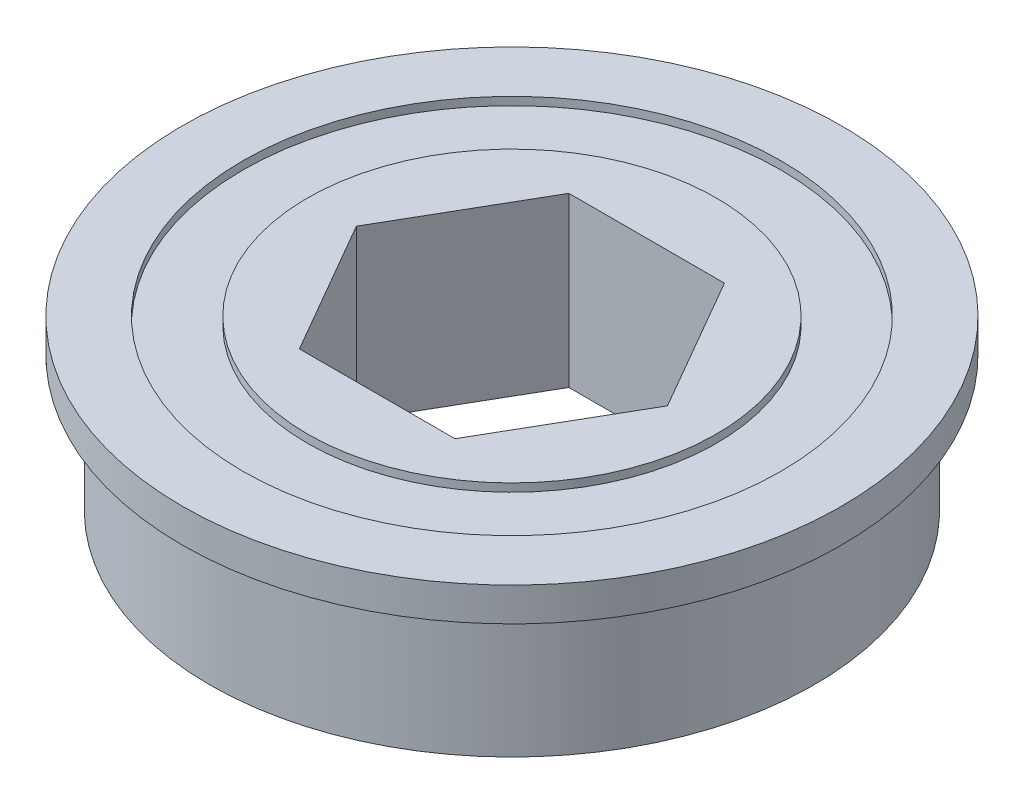
ISO-10303-21;
HEADER;
FILE_DESCRIPTION(('STEP AP214'),'2;1');
FILE_NAME('part.step','',(''),(''),'','','');
FILE_SCHEMA(('AUTOMOTIVE_DESIGN { 1 0 10303 214 1 1 1 1 }'));
ENDSEC;
DATA;
#1=APPLICATION_CONTEXT('core data for automotive mechanical design processes');
#2=APPLICATION_PROTOCOL_DEFINITION('international standard','automotive_design',2000,#1);
#3=PRODUCT_CONTEXT('',#1,'mechanical');
#4=PRODUCT('Part','Part','',(#3));
#5=PRODUCT_RELATED_PRODUCT_CATEGORY('part','',(#4));
#6=PRODUCT_DEFINITION_FORMATION('','',#4);
#7=PRODUCT_DEFINITION_CONTEXT('part definition',#1,'design');
#8=PRODUCT_DEFINITION('design','',#6,#7);
#9=PRODUCT_DEFINITION_SHAPE('','',#8);
#10=(LENGTH_UNIT() NAMED_UNIT(*) SI_UNIT(.MILLI.,.METRE.));
#11=(NAMED_UNIT(*) PLANE_ANGLE_UNIT() SI_UNIT($,.RADIAN.));
#12=(NAMED_UNIT(*) SI_UNIT($,.STERADIAN.) SOLID_ANGLE_UNIT());
#13=UNCERTAINTY_MEASURE_WITH_UNIT(LENGTH_MEASURE(1.E-05),#10,'distance_accuracy_value','');
#14=(GEOMETRIC_REPRESENTATION_CONTEXT(3) GLOBAL_UNCERTAINTY_ASSIGNED_CONTEXT((#13)) GLOBAL_UNIT_ASSIGNED_CONTEXT((#10,
#11,#12)) REPRESENTATION_CONTEXT('',''));
#15=CARTESIAN_POINT('',(0.,0.,0.));
#16=DIRECTION('',(0.,0.,1.));
#17=DIRECTION('',(1.,0.,0.));
#18=AXIS2_PLACEMENT_3D('',#15,#16,#17);
#19=CARTESIAN_POINT('',(0.,0.,0.));
#20=DIRECTION('',(0.,1.,0.));
#21=DIRECTION('',(0.,0.,1.));
#22=AXIS2_PLACEMENT_3D('',#19,#20,#21);
#23=CYLINDRICAL_SURFACE('',#22,12.7);
#24=CARTESIAN_POINT('',(0.,0.381,0.));
#25=DIRECTION('',(0.,1.,0.));
#26=DIRECTION('',(0.,0.,1.));
#27=AXIS2_PLACEMENT_3D('',#24,#25,#26);
#28=CIRCLE('',#27,12.7);
#29=CARTESIAN_POINT('',(0.,0.381,12.7));
#30=VERTEX_POINT('',#29);
#31=EDGE_CURVE('E361',#30,#30,#28,.F.);
#32=ORIENTED_EDGE('',*,*,#31,.F.);
#33=EDGE_LOOP('',(#32));
#34=FACE_BOUND('',#33,.T.);
#35=CARTESIAN_POINT('',(0.,0.,0.));
#36=DIRECTION('',(0.,1.,0.));
#37=DIRECTION('',(0.,0.,1.));
#38=AXIS2_PLACEMENT_3D('',#35,#36,#37);
#39=CIRCLE('',#38,12.7);
#40=CARTESIAN_POINT('',(0.,0.,12.7));
#41=VERTEX_POINT('',#40);
#42=EDGE_CURVE('E355',#41,#41,#39,.T.);
#43=ORIENTED_EDGE('',*,*,#42,.F.);
#44=EDGE_LOOP('',(#43));
#45=FACE_BOUND('',#44,.T.);
#46=ADVANCED_FACE('F19',(#34,#45),#23,.F.);
#47=CARTESIAN_POINT('',(9.652,0.381,0.));
#48=DIRECTION('',(0.,-1.,0.));
#49=DIRECTION('',(0.,0.,-1.));
#50=AXIS2_PLACEMENT_3D('',#47,#48,#49);
#51=PLANE('',#50);
#52=ORIENTED_EDGE('',*,*,#31,.T.);
#53=EDGE_LOOP('',(#52));
#54=FACE_BOUND('',#53,.T.);
#55=CARTESIAN_POINT('',(0.,0.381,0.));
#56=DIRECTION('',(0.,1.,0.));
#57=DIRECTION('',(0.,0.,1.));
#58=AXIS2_PLACEMENT_3D('',#55,#56,#57);
#59=CIRCLE('',#58,9.652);
#60=CARTESIAN_POINT('',(0.,0.381,9.652));
#61=VERTEX_POINT('',#60);
#62=EDGE_CURVE('E360',#61,#61,#59,.F.);
#63=ORIENTED_EDGE('',*,*,#62,.F.);
#64=EDGE_LOOP('',(#63));
#65=FACE_BOUND('',#64,.T.);
#66=ADVANCED_FACE('F266',(#54,#65),#51,.T.);
#67=CARTESIAN_POINT('',(14.2748,0.,0.));
#68=DIRECTION('',(0.,-1.,0.));
#69=DIRECTION('',(0.,0.,-1.));
#70=AXIS2_PLACEMENT_3D('',#67,#68,#69);
#71=PLANE('',#70);
#72=CARTESIAN_POINT('',(0.,0.,0.));
#73=DIRECTION('',(0.,1.,0.));
#74=DIRECTION('',(0.,0.,1.));
#75=AXIS2_PLACEMENT_3D('',#72,#73,#74);
#76=CIRCLE('',#75,14.2748);
#77=CARTESIAN_POINT('',(0.,0.,14.2748));
#78=VERTEX_POINT('',#77);
#79=EDGE_CURVE('E367',#78,#78,#76,.T.);
#80=ORIENTED_EDGE('',*,*,#79,.F.);
#81=EDGE_LOOP('',(#80));
#82=FACE_BOUND('',#81,.T.);
#83=ORIENTED_EDGE('',*,*,#42,.T.);
#84=EDGE_LOOP('',(#83));
#85=FACE_BOUND('',#84,.T.);
#86=ADVANCED_FACE('F263',(#82,#85),#71,.T.);
#87=CARTESIAN_POINT('',(0.,0.,0.));
#88=DIRECTION('',(0.,1.,0.));
#89=DIRECTION('',(0.,0.,1.));
#90=AXIS2_PLACEMENT_3D('',#87,#88,#89);
#91=CYLINDRICAL_SURFACE('',#90,9.652);
#92=CARTESIAN_POINT('',(0.,0.,0.));
#93=DIRECTION('',(0.,1.,0.));
#94=DIRECTION('',(0.,0.,1.));
#95=AXIS2_PLACEMENT_3D('',#92,#93,#94);
#96=CIRCLE('',#95,9.652);
#97=CARTESIAN_POINT('',(0.,0.,9.652));
#98=VERTEX_POINT('',#97);
#99=EDGE_CURVE('E371',#98,#98,#96,.F.);
#100=ORIENTED_EDGE('',*,*,#99,.F.);
#101=EDGE_LOOP('',(#100));
#102=FACE_BOUND('',#101,.T.);
#103=ORIENTED_EDGE('',*,*,#62,.T.);
#104=EDGE_LOOP('',(#103));
#105=FACE_BOUND('',#104,.T.);
#106=ADVANCED_FACE('F259',(#102,#105),#91,.T.);
#107=CARTESIAN_POINT('',(0.,0.,0.));
#108=DIRECTION('',(0.,1.,0.));
#109=DIRECTION('',(0.,0.,1.));
#110=AXIS2_PLACEMENT_3D('',#107,#108,#109);
#111=CYLINDRICAL_SURFACE('',#110,14.2748);
#112=ORIENTED_EDGE('',*,*,#79,.T.);
#113=EDGE_LOOP('',(#112));
#114=FACE_BOUND('',#113,.T.);
#115=CARTESIAN_POINT('',(0.,5.6,0.));
#116=DIRECTION('',(0.,-1.,0.));
#117=DIRECTION('',(0.,0.,-1.));
#118=AXIS2_PLACEMENT_3D('',#115,#116,#117);
#119=CIRCLE('',#118,14.2748);
#120=CARTESIAN_POINT('',(0.,5.6,-14.2748));
#121=VERTEX_POINT('',#120);
#122=EDGE_CURVE('E85',#121,#121,#119,.F.);
#123=ORIENTED_EDGE('',*,*,#122,.F.);
#124=EDGE_LOOP('',(#123));
#125=FACE_BOUND('',#124,.T.);
#126=ADVANCED_FACE('F255',(#114,#125),#111,.T.);
#127=CARTESIAN_POINT('',(9.652,0.,0.));
#128=DIRECTION('',(0.,-1.,0.));
#129=DIRECTION('',(0.,0.,-1.));
#130=AXIS2_PLACEMENT_3D('',#127,#128,#129);
#131=PLANE('',#130);
#132=ORIENTED_EDGE('',*,*,#99,.T.);
#133=EDGE_LOOP('',(#132));
#134=FACE_BOUND('',#133,.T.);
#135=DIRECTION('',(1.,0.,0.));
#136=VECTOR('',#135,1.);
#137=CARTESIAN_POINT('',(-3.67194771204601,0.,6.36));
#138=LINE('',#137,#136);
#139=CARTESIAN_POINT('',(-3.67194771204601,0.,6.36));
#140=VERTEX_POINT('',#139);
#141=CARTESIAN_POINT('',(3.67194771204602,0.,6.36));
#142=VERTEX_POINT('',#141);
#143=EDGE_CURVE('E64',#140,#142,#138,.T.);
#144=ORIENTED_EDGE('',*,*,#143,.T.);
#145=DIRECTION('',(0.5,0.,-0.866025403784439));
#146=VECTOR('',#145,1.);
#147=CARTESIAN_POINT('',(3.67194771204602,0.,6.36));
#148=LINE('',#147,#146);
#149=CARTESIAN_POINT('',(7.34389542409204,0.,0.));
#150=VERTEX_POINT('',#149);
#151=EDGE_CURVE('E66',#142,#150,#148,.T.);
#152=ORIENTED_EDGE('',*,*,#151,.T.);
#153=DIRECTION('',(-0.5,0.,-0.866025403784439));
#154=VECTOR('',#153,1.);
#155=CARTESIAN_POINT('',(7.34389542409204,0.,0.));
#156=LINE('',#155,#154);
#157=CARTESIAN_POINT('',(3.67194771204602,0.,-6.36));
#158=VERTEX_POINT('',#157);
#159=EDGE_CURVE('E69',#150,#158,#156,.T.);
#160=ORIENTED_EDGE('',*,*,#159,.T.);
#161=DIRECTION('',(-1.,0.,0.));
#162=VECTOR('',#161,1.);
#163=CARTESIAN_POINT('',(3.67194771204602,0.,-6.36));
#164=LINE('',#163,#162);
#165=CARTESIAN_POINT('',(-3.67194771204602,0.,-6.36));
#166=VERTEX_POINT('',#165);
#167=EDGE_CURVE('E334',#158,#166,#164,.T.);
#168=ORIENTED_EDGE('',*,*,#167,.T.);
#169=DIRECTION('',(-0.5,0.,0.866025403784439));
#170=VECTOR('',#169,1.);
#171=CARTESIAN_POINT('',(-3.67194771204602,0.,-6.36));
#172=LINE('',#171,#170);
#173=CARTESIAN_POINT('',(-7.34389542409204,0.,0.));
#174=VERTEX_POINT('',#173);
#175=EDGE_CURVE('E121',#166,#174,#172,.T.);
#176=ORIENTED_EDGE('',*,*,#175,.T.);
#177=DIRECTION('',(0.5,0.,0.866025403784439));
#178=VECTOR('',#177,1.);
#179=CARTESIAN_POINT('',(-7.34389542409204,0.,0.));
#180=LINE('',#179,#178);
#181=EDGE_CURVE('E112',#174,#140,#180,.T.);
#182=ORIENTED_EDGE('',*,*,#181,.T.);
#183=EDGE_LOOP('',(#144,#152,#160,#168,#176,#182));
#184=FACE_BOUND('',#183,.T.);
#185=ADVANCED_FACE('F68',(#134,#184),#131,.T.);
#186=CARTESIAN_POINT('',(0.,5.6,0.));
#187=DIRECTION('',(0.,-1.,0.));
#188=DIRECTION('',(0.,0.,-1.));
#189=AXIS2_PLACEMENT_3D('',#186,#187,#188);
#190=CONICAL_SURFACE('',#189,14.2748,0.523598775598298);
#191=CARTESIAN_POINT('',(0.,5.975,0.));
#192=DIRECTION('',(0.,1.,0.));
#193=DIRECTION('',(0.,0.,1.));
#194=AXIS2_PLACEMENT_3D('',#191,#192,#193);
#195=CIRCLE('',#194,14.0582936490539);
#196=CARTESIAN_POINT('',(0.,5.975,14.0582936490539));
#197=VERTEX_POINT('',#196);
#198=EDGE_CURVE('E328',#197,#197,#195,.F.);
#199=ORIENTED_EDGE('',*,*,#198,.T.);
#200=EDGE_LOOP('',(#199));
#201=FACE_BOUND('',#200,.T.);
#202=ORIENTED_EDGE('',*,*,#122,.T.);
#203=EDGE_LOOP('',(#202));
#204=FACE_BOUND('',#203,.T.);
#205=ADVANCED_FACE('F249',(#201,#204),#190,.T.);
#206=CARTESIAN_POINT('',(7.34389542409204,0.,0.));
#207=DIRECTION('',(0.866025403784439,0.,-0.5));
#208=DIRECTION('',(-0.5,0.,-0.866025403784439));
#209=AXIS2_PLACEMENT_3D('',#206,#207,#208);
#210=PLANE('',#209);
#211=DIRECTION('',(0.,1.,0.));
#212=VECTOR('',#211,1.);
#213=CARTESIAN_POINT('',(3.67194771204602,0.,-6.36));
#214=LINE('',#213,#212);
#215=CARTESIAN_POINT('',(3.67194771204602,7.9375,-6.36));
#216=VERTEX_POINT('',#215);
#217=EDGE_CURVE('E83',#216,#158,#214,.F.);
#218=ORIENTED_EDGE('',*,*,#217,.T.);
#219=ORIENTED_EDGE('',*,*,#159,.F.);
#220=DIRECTION('',(0.,1.,0.));
#221=VECTOR('',#220,1.);
#222=CARTESIAN_POINT('',(7.34389542409204,0.,0.));
#223=LINE('',#222,#221);
#224=CARTESIAN_POINT('',(7.34389542409204,7.9375,0.));
#225=VERTEX_POINT('',#224);
#226=EDGE_CURVE('E75',#150,#225,#223,.T.);
#227=ORIENTED_EDGE('',*,*,#226,.T.);
#228=DIRECTION('',(0.5,0.,0.866025403784438));
#229=VECTOR('',#228,1.);
#230=CARTESIAN_POINT('',(3.67194771204602,7.9375,-6.36));
#231=LINE('',#230,#229);
#232=EDGE_CURVE('E321',#216,#225,#231,.T.);
#233=ORIENTED_EDGE('',*,*,#232,.F.);
#234=EDGE_LOOP('',(#218,#219,#227,#233));
#235=FACE_BOUND('',#234,.T.);
#236=ADVANCED_FACE('F79',(#235),#210,.F.);
#237=CARTESIAN_POINT('',(3.67194771204602,0.,6.36));
#238=DIRECTION('',(0.866025403784439,0.,0.5));
#239=DIRECTION('',(0.5,0.,-0.866025403784439));
#240=AXIS2_PLACEMENT_3D('',#237,#238,#239);
#241=PLANE('',#240);
#242=ORIENTED_EDGE('',*,*,#226,.F.);
#243=ORIENTED_EDGE('',*,*,#151,.F.);
#244=DIRECTION('',(0.,1.,0.));
#245=VECTOR('',#244,1.);
#246=CARTESIAN_POINT('',(3.67194771204602,0.,6.36));
#247=LINE('',#246,#245);
#248=CARTESIAN_POINT('',(3.67194771204602,7.9375,6.36));
#249=VERTEX_POINT('',#248);
#250=EDGE_CURVE('E92',#142,#249,#247,.T.);
#251=ORIENTED_EDGE('',*,*,#250,.T.);
#252=DIRECTION('',(-0.5,0.,0.866025403784439));
#253=VECTOR('',#252,1.);
#254=CARTESIAN_POINT('',(7.34389542409204,7.9375,0.));
#255=LINE('',#254,#253);
#256=EDGE_CURVE('E89',#225,#249,#255,.T.);
#257=ORIENTED_EDGE('',*,*,#256,.F.);
#258=EDGE_LOOP('',(#242,#243,#251,#257));
#259=FACE_BOUND('',#258,.T.);
#260=ADVANCED_FACE('F87',(#259),#241,.F.);
#261=CARTESIAN_POINT('',(-3.67194771204601,0.,6.36));
#262=DIRECTION('',(0.,0.,1.));
#263=DIRECTION('',(1.,0.,0.));
#264=AXIS2_PLACEMENT_3D('',#261,#262,#263);
#265=PLANE('',#264);
#266=ORIENTED_EDGE('',*,*,#250,.F.);
#267=ORIENTED_EDGE('',*,*,#143,.F.);
#268=DIRECTION('',(0.,1.,0.));
#269=VECTOR('',#268,1.);
#270=CARTESIAN_POINT('',(-3.67194771204601,0.,6.36));
#271=LINE('',#270,#269);
#272=CARTESIAN_POINT('',(-3.67194771204601,7.9375,6.36));
#273=VERTEX_POINT('',#272);
#274=EDGE_CURVE('E117',#140,#273,#271,.T.);
#275=ORIENTED_EDGE('',*,*,#274,.T.);
#276=DIRECTION('',(1.,0.,0.));
#277=VECTOR('',#276,1.);
#278=CARTESIAN_POINT('',(6.35,7.9375,6.36));
#279=LINE('',#278,#277);
#280=EDGE_CURVE('E320',#249,#273,#279,.F.);
#281=ORIENTED_EDGE('',*,*,#280,.F.);
#282=EDGE_LOOP('',(#266,#267,#275,#281));
#283=FACE_BOUND('',#282,.T.);
#284=ADVANCED_FACE('F240',(#283),#265,.F.);
#285=CARTESIAN_POINT('',(-7.34389542409204,0.,0.));
#286=DIRECTION('',(-0.866025403784439,0.,0.5));
#287=DIRECTION('',(0.5,0.,0.866025403784439));
#288=AXIS2_PLACEMENT_3D('',#285,#286,#287);
#289=PLANE('',#288);
#290=ORIENTED_EDGE('',*,*,#274,.F.);
#291=ORIENTED_EDGE('',*,*,#181,.F.);
#292=DIRECTION('',(0.,1.,0.));
#293=VECTOR('',#292,1.);
#294=CARTESIAN_POINT('',(-7.34389542409204,0.,0.));
#295=LINE('',#294,#293);
#296=CARTESIAN_POINT('',(-7.34389542409204,7.9375,0.));
#297=VERTEX_POINT('',#296);
#298=EDGE_CURVE('E124',#174,#297,#295,.T.);
#299=ORIENTED_EDGE('',*,*,#298,.T.);
#300=DIRECTION('',(-0.5,0.,-0.866025403784439));
#301=VECTOR('',#300,1.);
#302=CARTESIAN_POINT('',(-3.67194771204601,7.9375,6.36));
#303=LINE('',#302,#301);
#304=EDGE_CURVE('E148',#273,#297,#303,.T.);
#305=ORIENTED_EDGE('',*,*,#304,.F.);
#306=EDGE_LOOP('',(#290,#291,#299,#305));
#307=FACE_BOUND('',#306,.T.);
#308=ADVANCED_FACE('F236',(#307),#289,.F.);
#309=CARTESIAN_POINT('',(-3.67194771204602,0.,-6.36));
#310=DIRECTION('',(-0.866025403784439,0.,-0.5));
#311=DIRECTION('',(-0.5,0.,0.866025403784439));
#312=AXIS2_PLACEMENT_3D('',#309,#310,#311);
#313=PLANE('',#312);
#314=ORIENTED_EDGE('',*,*,#298,.F.);
#315=ORIENTED_EDGE('',*,*,#175,.F.);
#316=DIRECTION('',(0.,1.,0.));
#317=VECTOR('',#316,1.);
#318=CARTESIAN_POINT('',(-3.67194771204602,0.,-6.36));
#319=LINE('',#318,#317);
#320=CARTESIAN_POINT('',(-3.67194771204602,7.9375,-6.36));
#321=VERTEX_POINT('',#320);
#322=EDGE_CURVE('E329',#166,#321,#319,.T.);
#323=ORIENTED_EDGE('',*,*,#322,.T.);
#324=DIRECTION('',(0.5,0.,-0.866025403784439));
#325=VECTOR('',#324,1.);
#326=CARTESIAN_POINT('',(-7.34389542409204,7.9375,0.));
#327=LINE('',#326,#325);
#328=EDGE_CURVE('E143',#297,#321,#327,.T.);
#329=ORIENTED_EDGE('',*,*,#328,.F.);
#330=EDGE_LOOP('',(#314,#315,#323,#329));
#331=FACE_BOUND('',#330,.T.);
#332=ADVANCED_FACE('F232',(#331),#313,.F.);
#333=CARTESIAN_POINT('',(3.67194771204602,0.,-6.36));
#334=DIRECTION('',(0.,0.,-1.));
#335=DIRECTION('',(-1.,0.,0.));
#336=AXIS2_PLACEMENT_3D('',#333,#334,#335);
#337=PLANE('',#336);
#338=ORIENTED_EDGE('',*,*,#322,.F.);
#339=ORIENTED_EDGE('',*,*,#167,.F.);
#340=ORIENTED_EDGE('',*,*,#217,.F.);
#341=DIRECTION('',(1.,0.,0.));
#342=VECTOR('',#341,1.);
#343=CARTESIAN_POINT('',(6.35,7.9375,-6.36));
#344=LINE('',#343,#342);
#345=EDGE_CURVE('E147',#321,#216,#344,.T.);
#346=ORIENTED_EDGE('',*,*,#345,.F.);
#347=EDGE_LOOP('',(#338,#339,#340,#346));
#348=FACE_BOUND('',#347,.T.);
#349=ADVANCED_FACE('F228',(#348),#337,.F.);
#350=CARTESIAN_POINT('',(6.35,7.9375,0.));
#351=DIRECTION('',(0.,1.,0.));
#352=DIRECTION('',(0.,0.,1.));
#353=AXIS2_PLACEMENT_3D('',#350,#351,#352);
#354=PLANE('',#353);
#355=CARTESIAN_POINT('',(0.,7.9375,0.));
#356=DIRECTION('',(0.,1.,0.));
#357=DIRECTION('',(0.,0.,1.));
#358=AXIS2_PLACEMENT_3D('',#355,#356,#357);
#359=CIRCLE('',#358,9.652);
#360=CARTESIAN_POINT('',(0.,7.9375,9.652));
#361=VERTEX_POINT('',#360);
#362=EDGE_CURVE('E375',#361,#361,#359,.F.);
#363=ORIENTED_EDGE('',*,*,#362,.F.);
#364=EDGE_LOOP('',(#363));
#365=FACE_BOUND('',#364,.T.);
#366=ORIENTED_EDGE('',*,*,#328,.T.);
#367=ORIENTED_EDGE('',*,*,#345,.T.);
#368=ORIENTED_EDGE('',*,*,#232,.T.);
#369=ORIENTED_EDGE('',*,*,#256,.T.);
#370=ORIENTED_EDGE('',*,*,#280,.T.);
#371=ORIENTED_EDGE('',*,*,#304,.T.);
#372=EDGE_LOOP('',(#366,#367,#368,#369,#370,#371));
#373=FACE_BOUND('',#372,.T.);
#374=ADVANCED_FACE('F216',(#365,#373),#354,.T.);
#375=CARTESIAN_POINT('',(0.,6.1,0.));
#376=DIRECTION('',(0.,1.,0.));
#377=DIRECTION('',(0.,0.,1.));
#378=AXIS2_PLACEMENT_3D('',#375,#376,#377);
#379=TOROIDAL_SURFACE('',#378,14.2748,0.25);
#380=ORIENTED_EDGE('',*,*,#198,.F.);
#381=EDGE_LOOP('',(#380));
#382=FACE_BOUND('',#381,.T.);
#383=CARTESIAN_POINT('',(0.,6.35,0.));
#384=DIRECTION('',(0.,-1.,0.));
#385=DIRECTION('',(0.,0.,-1.));
#386=AXIS2_PLACEMENT_3D('',#383,#384,#385);
#387=CIRCLE('',#386,14.2748);
#388=CARTESIAN_POINT('',(0.,6.35,14.2748));
#389=VERTEX_POINT('',#388);
#390=CARTESIAN_POINT('',(0.,6.35,-14.2748));
#391=VERTEX_POINT('',#390);
#392=EDGE_CURVE('E377',#389,#391,#387,.F.);
#393=ORIENTED_EDGE('',*,*,#392,.F.);
#394=CARTESIAN_POINT('',(0.,6.35,0.));
#395=DIRECTION('',(0.,-1.,0.));
#396=DIRECTION('',(0.,0.,1.));
#397=AXIS2_PLACEMENT_3D('',#394,#395,#396);
#398=CIRCLE('',#397,14.2748);
#399=EDGE_CURVE('E38',#391,#389,#398,.F.);
#400=ORIENTED_EDGE('',*,*,#399,.F.);
#401=EDGE_LOOP('',(#393,#400));
#402=FACE_BOUND('',#401,.T.);
#403=ADVANCED_FACE('F212',(#382,#402),#379,.F.);
#404=CARTESIAN_POINT('',(0.,0.,0.));
#405=DIRECTION('',(0.,1.,0.));
#406=DIRECTION('',(0.,0.,1.));
#407=AXIS2_PLACEMENT_3D('',#404,#405,#406);
#408=CYLINDRICAL_SURFACE('',#407,9.652);
#409=CARTESIAN_POINT('',(0.,7.5565,0.));
#410=DIRECTION('',(0.,1.,0.));
#411=DIRECTION('',(0.,0.,1.));
#412=AXIS2_PLACEMENT_3D('',#409,#410,#411);
#413=CIRCLE('',#412,9.652);
#414=CARTESIAN_POINT('',(0.,7.5565,9.652));
#415=VERTEX_POINT('',#414);
#416=EDGE_CURVE('E302',#415,#415,#413,.F.);
#417=ORIENTED_EDGE('',*,*,#416,.F.);
#418=EDGE_LOOP('',(#417));
#419=FACE_BOUND('',#418,.T.);
#420=ORIENTED_EDGE('',*,*,#362,.T.);
#421=EDGE_LOOP('',(#420));
#422=FACE_BOUND('',#421,.T.);
#423=ADVANCED_FACE('F199',(#419,#422),#408,.T.);
#424=CARTESIAN_POINT('',(15.5575,6.35,0.));
#425=DIRECTION('',(0.,-1.,0.));
#426=DIRECTION('',(0.,0.,-1.));
#427=AXIS2_PLACEMENT_3D('',#424,#425,#426);
#428=PLANE('',#427);
#429=CARTESIAN_POINT('',(0.,6.35,0.));
#430=DIRECTION('',(0.,1.,0.));
#431=DIRECTION('',(0.,0.,1.));
#432=AXIS2_PLACEMENT_3D('',#429,#430,#431);
#433=CIRCLE('',#432,15.5575);
#434=CARTESIAN_POINT('',(0.,6.35,15.5575));
#435=VERTEX_POINT('',#434);
#436=EDGE_CURVE('E300',#435,#435,#433,.T.);
#437=ORIENTED_EDGE('',*,*,#436,.F.);
#438=EDGE_LOOP('',(#437));
#439=FACE_BOUND('',#438,.T.);
#440=ORIENTED_EDGE('',*,*,#392,.T.);
#441=ORIENTED_EDGE('',*,*,#399,.T.);
#442=EDGE_LOOP('',(#440,#441));
#443=FACE_BOUND('',#442,.T.);
#444=ADVANCED_FACE('F188',(#439,#443),#428,.T.);
#445=CARTESIAN_POINT('',(9.652,7.5565,0.));
#446=DIRECTION('',(0.,1.,0.));
#447=DIRECTION('',(0.,0.,1.));
#448=AXIS2_PLACEMENT_3D('',#445,#446,#447);
#449=PLANE('',#448);
#450=ORIENTED_EDGE('',*,*,#416,.T.);
#451=EDGE_LOOP('',(#450));
#452=FACE_BOUND('',#451,.T.);
#453=CARTESIAN_POINT('',(0.,7.5565,0.));
#454=DIRECTION('',(0.,1.,0.));
#455=DIRECTION('',(0.,0.,1.));
#456=AXIS2_PLACEMENT_3D('',#453,#454,#455);
#457=CIRCLE('',#456,12.7);
#458=CARTESIAN_POINT('',(0.,7.5565,12.7));
#459=VERTEX_POINT('',#458);
#460=EDGE_CURVE('E166',#459,#459,#457,.T.);
#461=ORIENTED_EDGE('',*,*,#460,.T.);
#462=EDGE_LOOP('',(#461));
#463=FACE_BOUND('',#462,.T.);
#464=ADVANCED_FACE('F198',(#452,#463),#449,.T.);
#465=CARTESIAN_POINT('',(0.,0.,0.));
#466=DIRECTION('',(0.,1.,0.));
#467=DIRECTION('',(0.,0.,1.));
#468=AXIS2_PLACEMENT_3D('',#465,#466,#467);
#469=CYLINDRICAL_SURFACE('',#468,15.5575);
#470=ORIENTED_EDGE('',*,*,#436,.T.);
#471=EDGE_LOOP('',(#470));
#472=FACE_BOUND('',#471,.T.);
#473=CARTESIAN_POINT('',(0.,7.9375,0.));
#474=DIRECTION('',(0.,1.,0.));
#475=DIRECTION('',(0.,0.,1.));
#476=AXIS2_PLACEMENT_3D('',#473,#474,#475);
#477=CIRCLE('',#476,15.5575);
#478=CARTESIAN_POINT('',(0.,7.9375,15.5575));
#479=VERTEX_POINT('',#478);
#480=EDGE_CURVE('E30',#479,#479,#477,.T.);
#481=ORIENTED_EDGE('',*,*,#480,.F.);
#482=EDGE_LOOP('',(#481));
#483=FACE_BOUND('',#482,.T.);
#484=ADVANCED_FACE('F286',(#472,#483),#469,.T.);
#485=CARTESIAN_POINT('',(0.,0.,0.));
#486=DIRECTION('',(0.,1.,0.));
#487=DIRECTION('',(0.,0.,1.));
#488=AXIS2_PLACEMENT_3D('',#485,#486,#487);
#489=CYLINDRICAL_SURFACE('',#488,12.7);
#490=CARTESIAN_POINT('',(0.,7.9375,0.));
#491=DIRECTION('',(0.,1.,0.));
#492=DIRECTION('',(0.,0.,1.));
#493=AXIS2_PLACEMENT_3D('',#490,#491,#492);
#494=CIRCLE('',#493,12.7);
#495=CARTESIAN_POINT('',(0.,7.9375,12.7));
#496=VERTEX_POINT('',#495);
#497=EDGE_CURVE('E12',#496,#496,#494,.F.);
#498=ORIENTED_EDGE('',*,*,#497,.F.);
#499=EDGE_LOOP('',(#498));
#500=FACE_BOUND('',#499,.T.);
#501=ORIENTED_EDGE('',*,*,#460,.F.);
#502=EDGE_LOOP('',(#501));
#503=FACE_BOUND('',#502,.T.);
#504=ADVANCED_FACE('F279',(#500,#503),#489,.F.);
#505=CARTESIAN_POINT('',(12.7,7.9375,0.));
#506=DIRECTION('',(0.,1.,0.));
#507=DIRECTION('',(0.,0.,1.));
#508=AXIS2_PLACEMENT_3D('',#505,#506,#507);
#509=PLANE('',#508);
#510=ORIENTED_EDGE('',*,*,#497,.T.);
#511=EDGE_LOOP('',(#510));
#512=FACE_BOUND('',#511,.T.);
#513=ORIENTED_EDGE('',*,*,#480,.T.);
#514=EDGE_LOOP('',(#513));
#515=FACE_BOUND('',#514,.T.);
#516=ADVANCED_FACE('F277',(#512,#515),#509,.T.);
#517=CLOSED_SHELL('',(#46,#66,#86,#106,#126,#185,#205,#236,#260,#284,#308,#332,#349,#374,#403,
#423,#444,#464,#484,#504,#516));
#518=MANIFOLD_SOLID_BREP('B1',#517);
#519=ADVANCED_BREP_SHAPE_REPRESENTATION('',(#18,#518),#14);
#520=SHAPE_DEFINITION_REPRESENTATION(#9,#519);
ENDSEC;
END-ISO-10303-21;
